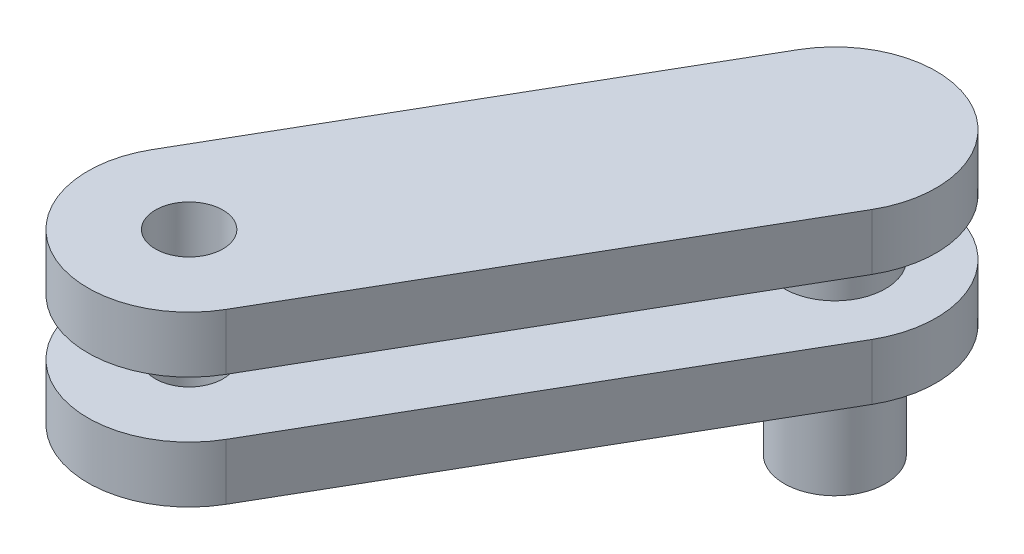
ISO-10303-21;
HEADER;
FILE_DESCRIPTION(('STEP AP214'),'2;1');
FILE_NAME('part.step','',(''),(''),'','','');
FILE_SCHEMA(('AUTOMOTIVE_DESIGN { 1 0 10303 214 1 1 1 1 }'));
ENDSEC;
DATA;
#1=APPLICATION_CONTEXT('core data for automotive mechanical design processes');
#2=APPLICATION_PROTOCOL_DEFINITION('international standard','automotive_design',2000,#1);
#3=PRODUCT_CONTEXT('',#1,'mechanical');
#4=PRODUCT('Part','Part','',(#3));
#5=PRODUCT_RELATED_PRODUCT_CATEGORY('part','',(#4));
#6=PRODUCT_DEFINITION_FORMATION('','',#4);
#7=PRODUCT_DEFINITION_CONTEXT('part definition',#1,'design');
#8=PRODUCT_DEFINITION('design','',#6,#7);
#9=PRODUCT_DEFINITION_SHAPE('','',#8);
#10=(LENGTH_UNIT() NAMED_UNIT(*) SI_UNIT(.MILLI.,.METRE.));
#11=(NAMED_UNIT(*) PLANE_ANGLE_UNIT() SI_UNIT($,.RADIAN.));
#12=(NAMED_UNIT(*) SI_UNIT($,.STERADIAN.) SOLID_ANGLE_UNIT());
#13=UNCERTAINTY_MEASURE_WITH_UNIT(LENGTH_MEASURE(1.E-05),#10,'distance_accuracy_value','');
#14=(GEOMETRIC_REPRESENTATION_CONTEXT(3) GLOBAL_UNCERTAINTY_ASSIGNED_CONTEXT((#13)) GLOBAL_UNIT_ASSIGNED_CONTEXT((#10,
#11,#12)) REPRESENTATION_CONTEXT('',''));
#15=CARTESIAN_POINT('',(0.,0.,0.));
#16=DIRECTION('',(0.,0.,1.));
#17=DIRECTION('',(1.,0.,0.));
#18=AXIS2_PLACEMENT_3D('',#15,#16,#17);
#19=CARTESIAN_POINT('',(-379.944100226322,100.,20.7982370649041));
#20=DIRECTION('',(0.,-1.,0.));
#21=DIRECTION('',(0.,0.,-1.));
#22=AXIS2_PLACEMENT_3D('',#19,#20,#21);
#23=PLANE('',#22);
#24=CARTESIAN_POINT('',(-434.944100226293,100.,116.061031481164));
#25=DIRECTION('',(0.,-1.,0.));
#26=DIRECTION('',(0.,0.,-1.));
#27=AXIS2_PLACEMENT_3D('',#24,#25,#26);
#28=CIRCLE('',#27,15.);
#29=CARTESIAN_POINT('',(-434.944100226293,100.,101.061031481164));
#30=VERTEX_POINT('',#29);
#31=EDGE_CURVE('E322',#30,#30,#28,.T.);
#32=ORIENTED_EDGE('',*,*,#31,.F.);
#33=EDGE_LOOP('',(#32));
#34=FACE_BOUND('',#33,.T.);
#35=DIRECTION('',(-0.500000000000443,0.,0.866025403784183));
#36=VECTOR('',#35,1.);
#37=CARTESIAN_POINT('',(-290.972957055926,100.,-43.3043033134757));
#38=LINE('',#37,#36);
#39=CARTESIAN_POINT('',(-290.972956581911,100.,-43.3043041348106));
#40=VERTEX_POINT('',#39);
#41=CARTESIAN_POINT('',(-395.972957056006,100.,138.561031481157));
#42=VERTEX_POINT('',#41);
#43=EDGE_CURVE('E146',#40,#42,#38,.T.);
#44=ORIENTED_EDGE('',*,*,#43,.T.);
#45=CARTESIAN_POINT('',(-434.944100226293,100.,116.061031481164));
#46=DIRECTION('',(0.,-1.,0.));
#47=DIRECTION('',(0.,0.,-1.));
#48=AXIS2_PLACEMENT_3D('',#45,#46,#47);
#49=CIRCLE('',#48,45.0000000000257);
#50=CARTESIAN_POINT('',(-473.91524339665,100.,93.5610314811315));
#51=VERTEX_POINT('',#50);
#52=EDGE_CURVE('E130',#42,#51,#49,.T.);
#53=ORIENTED_EDGE('',*,*,#52,.T.);
#54=DIRECTION('',(0.500000000000442,0.,-0.866025403784183));
#55=VECTOR('',#54,1.);
#56=CARTESIAN_POINT('',(-468.915243396612,100.,84.9007774432555));
#57=LINE('',#56,#55);
#58=CARTESIAN_POINT('',(-368.915243396523,100.,-88.304303313581));
#59=VERTEX_POINT('',#58);
#60=EDGE_CURVE('E125',#51,#59,#57,.T.);
#61=ORIENTED_EDGE('',*,*,#60,.T.);
#62=CARTESIAN_POINT('',(-329.944100226293,100.,-65.8043033135681));
#63=DIRECTION('',(0.,-1.,0.));
#64=DIRECTION('',(-0.866025403783927,0.,-0.500000000000886));
#65=AXIS2_PLACEMENT_3D('',#62,#63,#64);
#66=CIRCLE('',#65,44.9999999999462);
#67=EDGE_CURVE('E46',#59,#40,#66,.T.);
#68=ORIENTED_EDGE('',*,*,#67,.T.);
#69=EDGE_LOOP('',(#44,#53,#61,#68));
#70=FACE_BOUND('',#69,.T.);
#71=CARTESIAN_POINT('',(-329.944100226293,100.,-65.8043033135681));
#72=DIRECTION('',(0.,1.,0.));
#73=DIRECTION('',(1.,0.,0.));
#74=AXIS2_PLACEMENT_3D('',#71,#72,#73);
#75=CIRCLE('',#74,22.5);
#76=CARTESIAN_POINT('',(-352.444100226293,100.,-65.8043033135681));
#77=VERTEX_POINT('',#76);
#78=EDGE_CURVE('E177',#77,#77,#75,.T.);
#79=ORIENTED_EDGE('',*,*,#78,.T.);
#80=EDGE_LOOP('',(#79));
#81=FACE_BOUND('',#80,.T.);
#82=ADVANCED_FACE('F43',(#34,#70,#81),#23,.T.);
#83=CARTESIAN_POINT('',(-379.944100226322,125.,20.7982370649041));
#84=DIRECTION('',(0.,-1.,0.));
#85=DIRECTION('',(0.,0.,-1.));
#86=AXIS2_PLACEMENT_3D('',#83,#84,#85);
#87=PLANE('',#86);
#88=CARTESIAN_POINT('',(-434.944100226293,125.,116.061031481164));
#89=DIRECTION('',(0.,-1.,0.));
#90=DIRECTION('',(0.,0.,-1.));
#91=AXIS2_PLACEMENT_3D('',#88,#89,#90);
#92=CIRCLE('',#91,15.);
#93=CARTESIAN_POINT('',(-434.944100226293,125.,101.061031481164));
#94=VERTEX_POINT('',#93);
#95=EDGE_CURVE('E317',#94,#94,#92,.T.);
#96=ORIENTED_EDGE('',*,*,#95,.T.);
#97=EDGE_LOOP('',(#96));
#98=FACE_BOUND('',#97,.T.);
#99=CARTESIAN_POINT('',(-329.944100226293,125.,-65.8043033135681));
#100=DIRECTION('',(0.,1.,0.));
#101=DIRECTION('',(1.,0.,0.));
#102=AXIS2_PLACEMENT_3D('',#99,#100,#101);
#103=CIRCLE('',#102,22.5);
#104=CARTESIAN_POINT('',(-352.444100226293,125.,-65.8043033135681));
#105=VERTEX_POINT('',#104);
#106=EDGE_CURVE('E174',#105,#105,#103,.T.);
#107=ORIENTED_EDGE('',*,*,#106,.F.);
#108=EDGE_LOOP('',(#107));
#109=FACE_BOUND('',#108,.T.);
#110=CARTESIAN_POINT('',(-329.944100226293,125.,-65.8043033135681));
#111=DIRECTION('',(0.,-1.,0.));
#112=DIRECTION('',(-0.866025403783927,0.,-0.500000000000886));
#113=AXIS2_PLACEMENT_3D('',#110,#111,#112);
#114=CIRCLE('',#113,44.9999999999462);
#115=CARTESIAN_POINT('',(-368.915243396523,125.,-88.304303313581));
#116=VERTEX_POINT('',#115);
#117=CARTESIAN_POINT('',(-290.972956581911,125.,-43.3043041348106));
#118=VERTEX_POINT('',#117);
#119=EDGE_CURVE('E11',#116,#118,#114,.T.);
#120=ORIENTED_EDGE('',*,*,#119,.F.);
#121=DIRECTION('',(0.500000000000442,0.,-0.866025403784183));
#122=VECTOR('',#121,1.);
#123=CARTESIAN_POINT('',(-468.915243396612,125.,84.9007774432555));
#124=LINE('',#123,#122);
#125=CARTESIAN_POINT('',(-473.915243396615,125.,93.5610314811515));
#126=VERTEX_POINT('',#125);
#127=EDGE_CURVE('E136',#126,#116,#124,.T.);
#128=ORIENTED_EDGE('',*,*,#127,.F.);
#129=CARTESIAN_POINT('',(-434.944100226293,125.,116.061031481164));
#130=DIRECTION('',(0.,-1.,0.));
#131=DIRECTION('',(0.,0.,-1.));
#132=AXIS2_PLACEMENT_3D('',#129,#130,#131);
#133=CIRCLE('',#132,45.0000000000257);
#134=CARTESIAN_POINT('',(-395.972957056052,125.,138.561031481157));
#135=VERTEX_POINT('',#134);
#136=EDGE_CURVE('E160',#126,#135,#133,.F.);
#137=ORIENTED_EDGE('',*,*,#136,.T.);
#138=DIRECTION('',(-0.500000000000443,0.,0.866025403784183));
#139=VECTOR('',#138,1.);
#140=CARTESIAN_POINT('',(-290.972957055926,125.,-43.3043033134757));
#141=LINE('',#140,#139);
#142=EDGE_CURVE('E100',#118,#135,#141,.T.);
#143=ORIENTED_EDGE('',*,*,#142,.F.);
#144=EDGE_LOOP('',(#120,#128,#137,#143));
#145=FACE_BOUND('',#144,.T.);
#146=ADVANCED_FACE('F265',(#98,#109,#145),#87,.F.);
#147=CARTESIAN_POINT('',(-329.944100226293,100.,-65.8043033135681));
#148=DIRECTION('',(0.,-1.,0.));
#149=DIRECTION('',(-0.866025403783927,0.,-0.500000000000886));
#150=AXIS2_PLACEMENT_3D('',#147,#148,#149);
#151=CYLINDRICAL_SURFACE('',#150,44.9999999999462);
#152=ORIENTED_EDGE('',*,*,#67,.F.);
#153=DIRECTION('',(0.,1.,0.));
#154=VECTOR('',#153,1.);
#155=CARTESIAN_POINT('',(-368.915243396523,100.,-88.304303313581));
#156=LINE('',#155,#154);
#157=EDGE_CURVE('E140',#59,#116,#156,.T.);
#158=ORIENTED_EDGE('',*,*,#157,.T.);
#159=ORIENTED_EDGE('',*,*,#119,.T.);
#160=DIRECTION('',(0.,1.,0.));
#161=VECTOR('',#160,1.);
#162=CARTESIAN_POINT('',(-290.972956581911,100.,-43.3043041348106));
#163=LINE('',#162,#161);
#164=EDGE_CURVE('E141',#40,#118,#163,.T.);
#165=ORIENTED_EDGE('',*,*,#164,.F.);
#166=EDGE_LOOP('',(#152,#158,#159,#165));
#167=FACE_BOUND('',#166,.T.);
#168=ADVANCED_FACE('F139',(#167),#151,.T.);
#169=CARTESIAN_POINT('',(-290.972957055926,100.,-43.3043033134757));
#170=DIRECTION('',(-0.866025403784183,0.,-0.500000000000443));
#171=DIRECTION('',(-0.500000000000443,0.,0.866025403784183));
#172=AXIS2_PLACEMENT_3D('',#169,#170,#171);
#173=PLANE('',#172);
#174=ORIENTED_EDGE('',*,*,#142,.T.);
#175=DIRECTION('',(0.,-1.,0.));
#176=VECTOR('',#175,1.);
#177=CARTESIAN_POINT('',(-395.972957056006,282.290058244069,138.561031481157));
#178=LINE('',#177,#176);
#179=EDGE_CURVE('E240',#135,#42,#178,.T.);
#180=ORIENTED_EDGE('',*,*,#179,.T.);
#181=ORIENTED_EDGE('',*,*,#43,.F.);
#182=ORIENTED_EDGE('',*,*,#164,.T.);
#183=EDGE_LOOP('',(#174,#180,#181,#182));
#184=FACE_BOUND('',#183,.T.);
#185=ADVANCED_FACE('F260',(#184),#173,.F.);
#186=CARTESIAN_POINT('',(-468.915243396612,100.,84.9007774432555));
#187=DIRECTION('',(0.866025403784183,0.,0.500000000000442));
#188=DIRECTION('',(0.,-1.,0.));
#189=AXIS2_PLACEMENT_3D('',#186,#187,#188);
#190=PLANE('',#189);
#191=ORIENTED_EDGE('',*,*,#157,.F.);
#192=ORIENTED_EDGE('',*,*,#60,.F.);
#193=DIRECTION('',(0.,-1.,0.));
#194=VECTOR('',#193,1.);
#195=CARTESIAN_POINT('',(-473.91524339665,282.290058244069,93.5610314811315));
#196=LINE('',#195,#194);
#197=EDGE_CURVE('E237',#126,#51,#196,.T.);
#198=ORIENTED_EDGE('',*,*,#197,.F.);
#199=ORIENTED_EDGE('',*,*,#127,.T.);
#200=EDGE_LOOP('',(#191,#192,#198,#199));
#201=FACE_BOUND('',#200,.T.);
#202=ADVANCED_FACE('F144',(#201),#190,.F.);
#203=CARTESIAN_POINT('',(-379.944100226322,150.,20.7982370649041));
#204=DIRECTION('',(0.,-1.,0.));
#205=DIRECTION('',(0.,0.,-1.));
#206=AXIS2_PLACEMENT_3D('',#203,#204,#205);
#207=PLANE('',#206);
#208=CARTESIAN_POINT('',(-434.944100226293,150.,116.061031481164));
#209=DIRECTION('',(0.,-1.,0.));
#210=DIRECTION('',(0.,0.,-1.));
#211=AXIS2_PLACEMENT_3D('',#208,#209,#210);
#212=CIRCLE('',#211,15.);
#213=CARTESIAN_POINT('',(-434.944100226293,150.,101.061031481164));
#214=VERTEX_POINT('',#213);
#215=EDGE_CURVE('E314',#214,#214,#212,.T.);
#216=ORIENTED_EDGE('',*,*,#215,.F.);
#217=EDGE_LOOP('',(#216));
#218=FACE_BOUND('',#217,.T.);
#219=CARTESIAN_POINT('',(-329.944100226293,150.,-65.8043033135681));
#220=DIRECTION('',(0.,1.,0.));
#221=DIRECTION('',(1.,0.,0.));
#222=AXIS2_PLACEMENT_3D('',#219,#220,#221);
#223=CIRCLE('',#222,22.5);
#224=CARTESIAN_POINT('',(-352.444100226293,150.,-65.8043033135681));
#225=VERTEX_POINT('',#224);
#226=EDGE_CURVE('E157',#225,#225,#223,.T.);
#227=ORIENTED_EDGE('',*,*,#226,.T.);
#228=EDGE_LOOP('',(#227));
#229=FACE_BOUND('',#228,.T.);
#230=CARTESIAN_POINT('',(-329.944100226293,150.,-65.8043033135681));
#231=DIRECTION('',(0.,-1.,0.));
#232=DIRECTION('',(-0.866025403783927,0.,-0.500000000000886));
#233=AXIS2_PLACEMENT_3D('',#230,#231,#232);
#234=CIRCLE('',#233,44.9999999999462);
#235=CARTESIAN_POINT('',(-368.915243396523,150.,-88.304303313581));
#236=VERTEX_POINT('',#235);
#237=CARTESIAN_POINT('',(-290.972956581911,150.,-43.3043041348106));
#238=VERTEX_POINT('',#237);
#239=EDGE_CURVE('E165',#236,#238,#234,.T.);
#240=ORIENTED_EDGE('',*,*,#239,.T.);
#241=DIRECTION('',(-0.500000000000443,0.,0.866025403784183));
#242=VECTOR('',#241,1.);
#243=CARTESIAN_POINT('',(-290.972957055926,150.,-43.3043033134757));
#244=LINE('',#243,#242);
#245=CARTESIAN_POINT('',(-395.972957056,150.,138.561031481187));
#246=VERTEX_POINT('',#245);
#247=EDGE_CURVE('E186',#238,#246,#244,.T.);
#248=ORIENTED_EDGE('',*,*,#247,.T.);
#249=CARTESIAN_POINT('',(-434.944100226293,150.,116.061031481164));
#250=DIRECTION('',(0.,-1.,0.));
#251=DIRECTION('',(0.,0.,-1.));
#252=AXIS2_PLACEMENT_3D('',#249,#250,#251);
#253=CIRCLE('',#252,45.0000000000057);
#254=CARTESIAN_POINT('',(-473.915243396598,150.,93.5610314811615));
#255=VERTEX_POINT('',#254);
#256=EDGE_CURVE('E209',#255,#246,#253,.F.);
#257=ORIENTED_EDGE('',*,*,#256,.F.);
#258=DIRECTION('',(0.500000000000442,0.,-0.866025403784183));
#259=VECTOR('',#258,1.);
#260=CARTESIAN_POINT('',(-468.915243396612,150.,84.9007774432555));
#261=LINE('',#260,#259);
#262=EDGE_CURVE('E180',#255,#236,#261,.T.);
#263=ORIENTED_EDGE('',*,*,#262,.T.);
#264=EDGE_LOOP('',(#240,#248,#257,#263));
#265=FACE_BOUND('',#264,.T.);
#266=ADVANCED_FACE('F205',(#218,#229,#265),#207,.T.);
#267=CARTESIAN_POINT('',(-379.944100226322,175.,20.7982370649041));
#268=DIRECTION('',(0.,-1.,0.));
#269=DIRECTION('',(0.,0.,-1.));
#270=AXIS2_PLACEMENT_3D('',#267,#268,#269);
#271=PLANE('',#270);
#272=CARTESIAN_POINT('',(-434.944100226293,175.,116.061031481164));
#273=DIRECTION('',(0.,1.,0.));
#274=DIRECTION('',(0.,0.,1.));
#275=AXIS2_PLACEMENT_3D('',#272,#273,#274);
#276=CIRCLE('',#275,15.);
#277=CARTESIAN_POINT('',(-434.944100226293,175.,131.061031481164));
#278=VERTEX_POINT('',#277);
#279=EDGE_CURVE('E318',#278,#278,#276,.T.);
#280=ORIENTED_EDGE('',*,*,#279,.F.);
#281=EDGE_LOOP('',(#280));
#282=FACE_BOUND('',#281,.T.);
#283=CARTESIAN_POINT('',(-329.944100226293,175.,-65.8043033135681));
#284=DIRECTION('',(0.,-1.,0.));
#285=DIRECTION('',(-0.866025403783927,0.,-0.500000000000886));
#286=AXIS2_PLACEMENT_3D('',#283,#284,#285);
#287=CIRCLE('',#286,44.9999999999462);
#288=CARTESIAN_POINT('',(-368.915243396523,175.,-88.304303313581));
#289=VERTEX_POINT('',#288);
#290=CARTESIAN_POINT('',(-290.972956581911,175.,-43.3043041348106));
#291=VERTEX_POINT('',#290);
#292=EDGE_CURVE('E137',#289,#291,#287,.T.);
#293=ORIENTED_EDGE('',*,*,#292,.F.);
#294=DIRECTION('',(0.500000000000442,0.,-0.866025403784183));
#295=VECTOR('',#294,1.);
#296=CARTESIAN_POINT('',(-468.915243396612,175.,84.9007774432555));
#297=LINE('',#296,#295);
#298=CARTESIAN_POINT('',(-473.915243396598,175.,93.5610314811615));
#299=VERTEX_POINT('',#298);
#300=EDGE_CURVE('E187',#299,#289,#297,.T.);
#301=ORIENTED_EDGE('',*,*,#300,.F.);
#302=CARTESIAN_POINT('',(-434.944100226293,175.,116.061031481164));
#303=DIRECTION('',(0.,1.,0.));
#304=DIRECTION('',(0.,0.,1.));
#305=AXIS2_PLACEMENT_3D('',#302,#303,#304);
#306=CIRCLE('',#305,45.0000000000057);
#307=CARTESIAN_POINT('',(-395.972957056017,175.,138.561031481177));
#308=VERTEX_POINT('',#307);
#309=EDGE_CURVE('E230',#299,#308,#306,.T.);
#310=ORIENTED_EDGE('',*,*,#309,.T.);
#311=DIRECTION('',(-0.500000000000443,0.,0.866025403784183));
#312=VECTOR('',#311,1.);
#313=CARTESIAN_POINT('',(-290.972957055926,175.,-43.3043033134757));
#314=LINE('',#313,#312);
#315=EDGE_CURVE('E161',#291,#308,#314,.T.);
#316=ORIENTED_EDGE('',*,*,#315,.F.);
#317=EDGE_LOOP('',(#293,#301,#310,#316));
#318=FACE_BOUND('',#317,.T.);
#319=ADVANCED_FACE('F283',(#282,#318),#271,.F.);
#320=CARTESIAN_POINT('',(-329.944100226293,150.,-65.8043033135681));
#321=DIRECTION('',(0.,-1.,0.));
#322=DIRECTION('',(-0.866025403783927,0.,-0.500000000000886));
#323=AXIS2_PLACEMENT_3D('',#320,#321,#322);
#324=CYLINDRICAL_SURFACE('',#323,44.9999999999462);
#325=ORIENTED_EDGE('',*,*,#239,.F.);
#326=DIRECTION('',(0.,1.,0.));
#327=VECTOR('',#326,1.);
#328=CARTESIAN_POINT('',(-368.915243396523,150.,-88.304303313581));
#329=LINE('',#328,#327);
#330=EDGE_CURVE('E182',#236,#289,#329,.T.);
#331=ORIENTED_EDGE('',*,*,#330,.T.);
#332=ORIENTED_EDGE('',*,*,#292,.T.);
#333=DIRECTION('',(0.,1.,0.));
#334=VECTOR('',#333,1.);
#335=CARTESIAN_POINT('',(-290.972956581911,150.,-43.3043041348106));
#336=LINE('',#335,#334);
#337=EDGE_CURVE('E166',#238,#291,#336,.T.);
#338=ORIENTED_EDGE('',*,*,#337,.F.);
#339=EDGE_LOOP('',(#325,#331,#332,#338));
#340=FACE_BOUND('',#339,.T.);
#341=ADVANCED_FACE('F280',(#340),#324,.T.);
#342=CARTESIAN_POINT('',(-290.972957055926,150.,-43.3043033134757));
#343=DIRECTION('',(-0.866025403784183,0.,-0.500000000000443));
#344=DIRECTION('',(-0.500000000000443,0.,0.866025403784183));
#345=AXIS2_PLACEMENT_3D('',#342,#343,#344);
#346=PLANE('',#345);
#347=ORIENTED_EDGE('',*,*,#247,.F.);
#348=ORIENTED_EDGE('',*,*,#337,.T.);
#349=ORIENTED_EDGE('',*,*,#315,.T.);
#350=DIRECTION('',(0.,1.,0.));
#351=VECTOR('',#350,1.);
#352=CARTESIAN_POINT('',(-395.972957056017,-184.568020383011,138.561031481177));
#353=LINE('',#352,#351);
#354=EDGE_CURVE('E215',#246,#308,#353,.T.);
#355=ORIENTED_EDGE('',*,*,#354,.F.);
#356=EDGE_LOOP('',(#347,#348,#349,#355));
#357=FACE_BOUND('',#356,.T.);
#358=ADVANCED_FACE('F216',(#357),#346,.F.);
#359=CARTESIAN_POINT('',(-468.915243396612,150.,84.9007774432555));
#360=DIRECTION('',(0.866025403784183,0.,0.500000000000442));
#361=DIRECTION('',(0.,-1.,0.));
#362=AXIS2_PLACEMENT_3D('',#359,#360,#361);
#363=PLANE('',#362);
#364=ORIENTED_EDGE('',*,*,#262,.F.);
#365=DIRECTION('',(0.,1.,0.));
#366=VECTOR('',#365,1.);
#367=CARTESIAN_POINT('',(-473.915243396598,-184.568020383011,93.5610314811615));
#368=LINE('',#367,#366);
#369=EDGE_CURVE('E226',#255,#299,#368,.T.);
#370=ORIENTED_EDGE('',*,*,#369,.T.);
#371=ORIENTED_EDGE('',*,*,#300,.T.);
#372=ORIENTED_EDGE('',*,*,#330,.F.);
#373=EDGE_LOOP('',(#364,#370,#371,#372));
#374=FACE_BOUND('',#373,.T.);
#375=ADVANCED_FACE('F252',(#374),#363,.F.);
#376=CARTESIAN_POINT('',(-329.944100226293,50.,-65.8043033135681));
#377=DIRECTION('',(0.,-1.,0.));
#378=DIRECTION('',(0.,0.,-1.));
#379=AXIS2_PLACEMENT_3D('',#376,#377,#378);
#380=PLANE('',#379);
#381=CARTESIAN_POINT('',(-329.944100226293,50.,-65.8043033135681));
#382=DIRECTION('',(0.,-1.,0.));
#383=DIRECTION('',(1.,0.,0.));
#384=AXIS2_PLACEMENT_3D('',#381,#382,#383);
#385=CIRCLE('',#384,22.5);
#386=CARTESIAN_POINT('',(-352.444100226293,50.,-65.8043033135681));
#387=VERTEX_POINT('',#386);
#388=EDGE_CURVE('E178',#387,#387,#385,.T.);
#389=ORIENTED_EDGE('',*,*,#388,.T.);
#390=EDGE_LOOP('',(#389));
#391=FACE_BOUND('',#390,.T.);
#392=ADVANCED_FACE('F291',(#391),#380,.T.);
#393=CARTESIAN_POINT('',(-329.944100226293,50.,-65.8043033135681));
#394=DIRECTION('',(0.,-1.,0.));
#395=DIRECTION('',(1.,0.,0.));
#396=AXIS2_PLACEMENT_3D('',#393,#394,#395);
#397=CYLINDRICAL_SURFACE('',#396,22.5);
#398=ORIENTED_EDGE('',*,*,#78,.F.);
#399=DIRECTION('',(0.,-1.,0.));
#400=VECTOR('',#399,1.);
#401=CARTESIAN_POINT('',(-352.444100226293,50.,-65.8043033135681));
#402=LINE('',#401,#400);
#403=EDGE_CURVE('E154',#77,#387,#402,.T.);
#404=ORIENTED_EDGE('',*,*,#403,.T.);
#405=ORIENTED_EDGE('',*,*,#388,.F.);
#406=ORIENTED_EDGE('',*,*,#403,.F.);
#407=EDGE_LOOP('',(#398,#404,#405,#406));
#408=FACE_BOUND('',#407,.T.);
#409=ADVANCED_FACE('F294',(#408),#397,.T.);
#410=CARTESIAN_POINT('',(-329.944100226293,50.,-65.8043033135681));
#411=DIRECTION('',(0.,-1.,0.));
#412=DIRECTION('',(1.,0.,0.));
#413=AXIS2_PLACEMENT_3D('',#410,#411,#412);
#414=CYLINDRICAL_SURFACE('',#413,22.5);
#415=ORIENTED_EDGE('',*,*,#226,.F.);
#416=DIRECTION('',(0.,-1.,0.));
#417=VECTOR('',#416,1.);
#418=CARTESIAN_POINT('',(-352.444100226293,50.,-65.8043033135681));
#419=LINE('',#418,#417);
#420=EDGE_CURVE('E90',#225,#105,#419,.T.);
#421=ORIENTED_EDGE('',*,*,#420,.T.);
#422=ORIENTED_EDGE('',*,*,#106,.T.);
#423=ORIENTED_EDGE('',*,*,#420,.F.);
#424=EDGE_LOOP('',(#415,#421,#422,#423));
#425=FACE_BOUND('',#424,.T.);
#426=ADVANCED_FACE('F300',(#425),#414,.T.);
#427=CARTESIAN_POINT('',(-434.944100226293,282.290058244069,116.061031481164));
#428=DIRECTION('',(0.,-1.,0.));
#429=DIRECTION('',(0.,0.,-1.));
#430=AXIS2_PLACEMENT_3D('',#427,#428,#429);
#431=CYLINDRICAL_SURFACE('',#430,45.0000000000257);
#432=ORIENTED_EDGE('',*,*,#136,.F.);
#433=ORIENTED_EDGE('',*,*,#197,.T.);
#434=ORIENTED_EDGE('',*,*,#52,.F.);
#435=ORIENTED_EDGE('',*,*,#179,.F.);
#436=EDGE_LOOP('',(#432,#433,#434,#435));
#437=FACE_BOUND('',#436,.T.);
#438=ADVANCED_FACE('F263',(#437),#431,.T.);
#439=CARTESIAN_POINT('',(-434.944100226293,-184.568020383011,116.061031481164));
#440=DIRECTION('',(0.,1.,0.));
#441=DIRECTION('',(0.,0.,1.));
#442=AXIS2_PLACEMENT_3D('',#439,#440,#441);
#443=CYLINDRICAL_SURFACE('',#442,45.0000000000057);
#444=ORIENTED_EDGE('',*,*,#369,.F.);
#445=ORIENTED_EDGE('',*,*,#256,.T.);
#446=ORIENTED_EDGE('',*,*,#354,.T.);
#447=ORIENTED_EDGE('',*,*,#309,.F.);
#448=EDGE_LOOP('',(#444,#445,#446,#447));
#449=FACE_BOUND('',#448,.T.);
#450=ADVANCED_FACE('F224',(#449),#443,.T.);
#451=CARTESIAN_POINT('',(-434.944100226293,50.,116.061031481164));
#452=DIRECTION('',(0.,1.,0.));
#453=DIRECTION('',(0.,0.,1.));
#454=AXIS2_PLACEMENT_3D('',#451,#452,#453);
#455=CYLINDRICAL_SURFACE('',#454,15.);
#456=ORIENTED_EDGE('',*,*,#215,.T.);
#457=EDGE_LOOP('',(#456));
#458=FACE_BOUND('',#457,.T.);
#459=ORIENTED_EDGE('',*,*,#279,.T.);
#460=EDGE_LOOP('',(#459));
#461=FACE_BOUND('',#460,.T.);
#462=ADVANCED_FACE('F337',(#458,#461),#455,.F.);
#463=ORIENTED_EDGE('',*,*,#31,.T.);
#464=EDGE_LOOP('',(#463));
#465=FACE_BOUND('',#464,.T.);
#466=ORIENTED_EDGE('',*,*,#95,.F.);
#467=EDGE_LOOP('',(#466));
#468=FACE_BOUND('',#467,.T.);
#469=ADVANCED_FACE('F334',(#465,#468),#455,.F.);
#470=CLOSED_SHELL('',(#82,#146,#168,#185,#202,#266,#319,#341,#358,#375,#392,#409,#426,#438,#450,
#462,#469));
#471=MANIFOLD_SOLID_BREP('B2',#470);
#472=ADVANCED_BREP_SHAPE_REPRESENTATION('',(#18,#471),#14);
#473=SHAPE_DEFINITION_REPRESENTATION(#9,#472);
ENDSEC;
END-ISO-10303-21;
